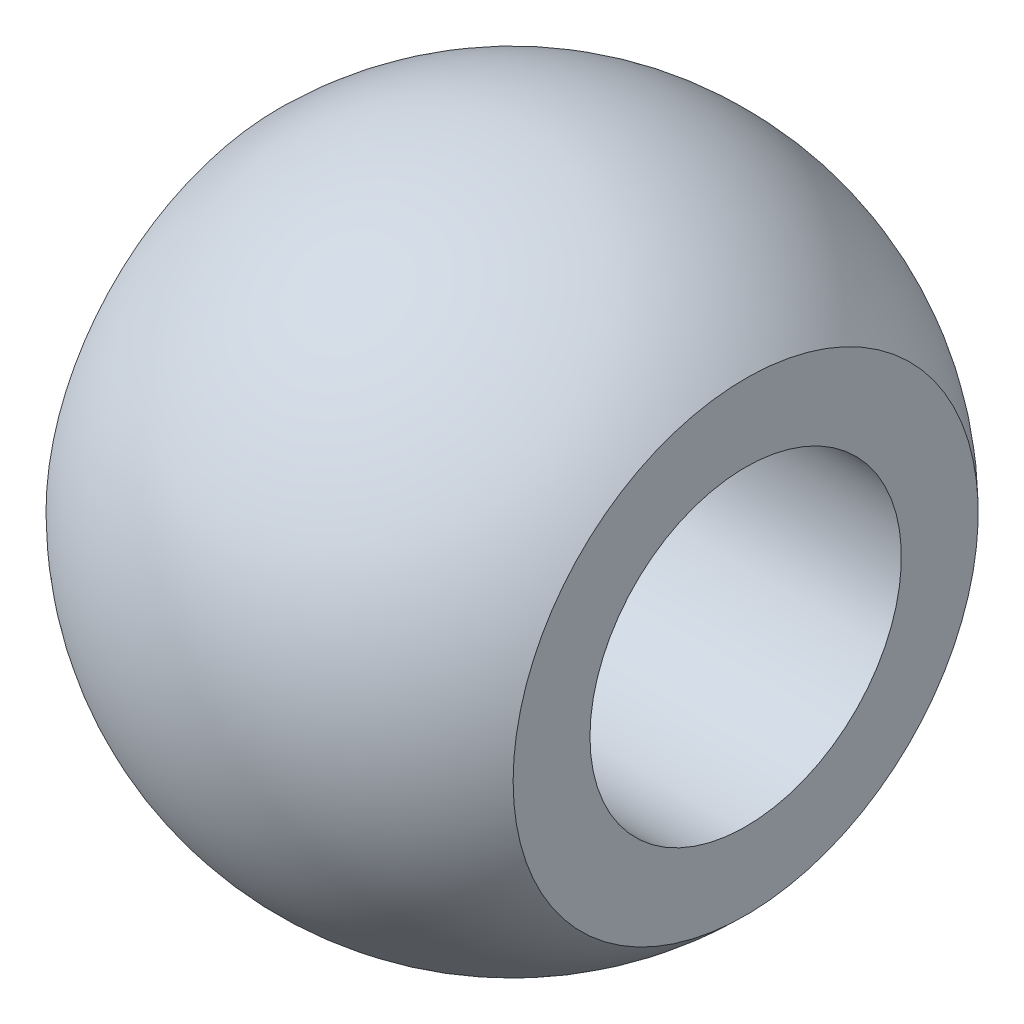
ISO-10303-21;
HEADER;
FILE_DESCRIPTION(('STEP AP214'),'2;1');
FILE_NAME('part.step','',(''),(''),'','','');
FILE_SCHEMA(('AUTOMOTIVE_DESIGN { 1 0 10303 214 1 1 1 1 }'));
ENDSEC;
DATA;
#1=APPLICATION_CONTEXT('core data for automotive mechanical design processes');
#2=APPLICATION_PROTOCOL_DEFINITION('international standard','automotive_design',2000,#1);
#3=PRODUCT_CONTEXT('',#1,'mechanical');
#4=PRODUCT('Part','Part','',(#3));
#5=PRODUCT_RELATED_PRODUCT_CATEGORY('part','',(#4));
#6=PRODUCT_DEFINITION_FORMATION('','',#4);
#7=PRODUCT_DEFINITION_CONTEXT('part definition',#1,'design');
#8=PRODUCT_DEFINITION('design','',#6,#7);
#9=PRODUCT_DEFINITION_SHAPE('','',#8);
#10=(LENGTH_UNIT() NAMED_UNIT(*) SI_UNIT(.MILLI.,.METRE.));
#11=(NAMED_UNIT(*) PLANE_ANGLE_UNIT() SI_UNIT($,.RADIAN.));
#12=(NAMED_UNIT(*) SI_UNIT($,.STERADIAN.) SOLID_ANGLE_UNIT());
#13=UNCERTAINTY_MEASURE_WITH_UNIT(LENGTH_MEASURE(1.E-05),#10,'distance_accuracy_value','');
#14=(GEOMETRIC_REPRESENTATION_CONTEXT(3) GLOBAL_UNCERTAINTY_ASSIGNED_CONTEXT((#13)) GLOBAL_UNIT_ASSIGNED_CONTEXT((#10,
#11,#12)) REPRESENTATION_CONTEXT('',''));
#15=CARTESIAN_POINT('',(0.,0.,0.));
#16=DIRECTION('',(0.,0.,1.));
#17=DIRECTION('',(1.,0.,0.));
#18=AXIS2_PLACEMENT_3D('',#15,#16,#17);
#19=CARTESIAN_POINT('',(4.5,0.,0.));
#20=DIRECTION('',(-1.,0.,0.));
#21=DIRECTION('',(0.,0.,1.));
#22=AXIS2_PLACEMENT_3D('',#19,#20,#21);
#23=PLANE('',#22);
#24=CARTESIAN_POINT('',(4.5,0.,0.));
#25=DIRECTION('',(-1.,0.,0.));
#26=DIRECTION('',(0.,0.,1.));
#27=AXIS2_PLACEMENT_3D('',#24,#25,#26);
#28=CIRCLE('',#27,4.48023436886956);
#29=CARTESIAN_POINT('',(4.5,0.,4.48023436886956));
#30=VERTEX_POINT('',#29);
#31=EDGE_CURVE('E10',#30,#30,#28,.T.);
#32=ORIENTED_EDGE('',*,*,#31,.F.);
#33=EDGE_LOOP('',(#32));
#34=FACE_BOUND('',#33,.T.);
#35=CARTESIAN_POINT('',(4.5,0.,0.));
#36=DIRECTION('',(-1.,0.,0.));
#37=DIRECTION('',(0.,0.,1.));
#38=AXIS2_PLACEMENT_3D('',#35,#36,#37);
#39=CIRCLE('',#38,3.);
#40=CARTESIAN_POINT('',(4.5,0.,3.));
#41=VERTEX_POINT('',#40);
#42=EDGE_CURVE('E55',#41,#41,#39,.T.);
#43=ORIENTED_EDGE('',*,*,#42,.T.);
#44=EDGE_LOOP('',(#43));
#45=FACE_BOUND('',#44,.T.);
#46=ADVANCED_FACE('F41',(#34,#45),#23,.F.);
#47=CARTESIAN_POINT('',(0.,0.,0.));
#48=DIRECTION('',(-1.,0.,0.));
#49=DIRECTION('',(0.,1.,0.));
#50=AXIS2_PLACEMENT_3D('',#47,#48,#49);
#51=SPHERICAL_SURFACE('',#50,6.35);
#52=CARTESIAN_POINT('',(-4.5,0.,0.));
#53=DIRECTION('',(-1.,0.,0.));
#54=DIRECTION('',(0.,0.,1.));
#55=AXIS2_PLACEMENT_3D('',#52,#53,#54);
#56=CIRCLE('',#55,4.48023436886956);
#57=CARTESIAN_POINT('',(-4.5,0.,4.48023436886956));
#58=VERTEX_POINT('',#57);
#59=EDGE_CURVE('E47',#58,#58,#56,.T.);
#60=ORIENTED_EDGE('',*,*,#59,.F.);
#61=EDGE_LOOP('',(#60));
#62=FACE_BOUND('',#61,.T.);
#63=ORIENTED_EDGE('',*,*,#31,.T.);
#64=EDGE_LOOP('',(#63));
#65=FACE_BOUND('',#64,.T.);
#66=ADVANCED_FACE('F70',(#62,#65),#51,.T.);
#67=CARTESIAN_POINT('',(-4.5,0.,0.));
#68=DIRECTION('',(-1.,0.,0.));
#69=DIRECTION('',(0.,0.,1.));
#70=AXIS2_PLACEMENT_3D('',#67,#68,#69);
#71=PLANE('',#70);
#72=ORIENTED_EDGE('',*,*,#59,.T.);
#73=EDGE_LOOP('',(#72));
#74=FACE_BOUND('',#73,.T.);
#75=CARTESIAN_POINT('',(-4.5,0.,0.));
#76=DIRECTION('',(-1.,0.,0.));
#77=DIRECTION('',(0.,0.,1.));
#78=AXIS2_PLACEMENT_3D('',#75,#76,#77);
#79=CIRCLE('',#78,3.);
#80=CARTESIAN_POINT('',(-4.5,0.,3.));
#81=VERTEX_POINT('',#80);
#82=EDGE_CURVE('E51',#81,#81,#79,.T.);
#83=ORIENTED_EDGE('',*,*,#82,.F.);
#84=EDGE_LOOP('',(#83));
#85=FACE_BOUND('',#84,.T.);
#86=ADVANCED_FACE('F65',(#74,#85),#71,.T.);
#87=CARTESIAN_POINT('',(0.,0.,0.));
#88=DIRECTION('',(-1.,0.,0.));
#89=DIRECTION('',(0.,0.,1.));
#90=AXIS2_PLACEMENT_3D('',#87,#88,#89);
#91=CYLINDRICAL_SURFACE('',#90,3.);
#92=ORIENTED_EDGE('',*,*,#42,.F.);
#93=EDGE_LOOP('',(#92));
#94=FACE_BOUND('',#93,.T.);
#95=ORIENTED_EDGE('',*,*,#82,.T.);
#96=EDGE_LOOP('',(#95));
#97=FACE_BOUND('',#96,.T.);
#98=ADVANCED_FACE('F62',(#94,#97),#91,.F.);
#99=CLOSED_SHELL('',(#46,#66,#86,#98));
#100=MANIFOLD_SOLID_BREP('B2',#99);
#101=ADVANCED_BREP_SHAPE_REPRESENTATION('',(#18,#100),#14);
#102=SHAPE_DEFINITION_REPRESENTATION(#9,#101);
ENDSEC;
END-ISO-10303-21;
